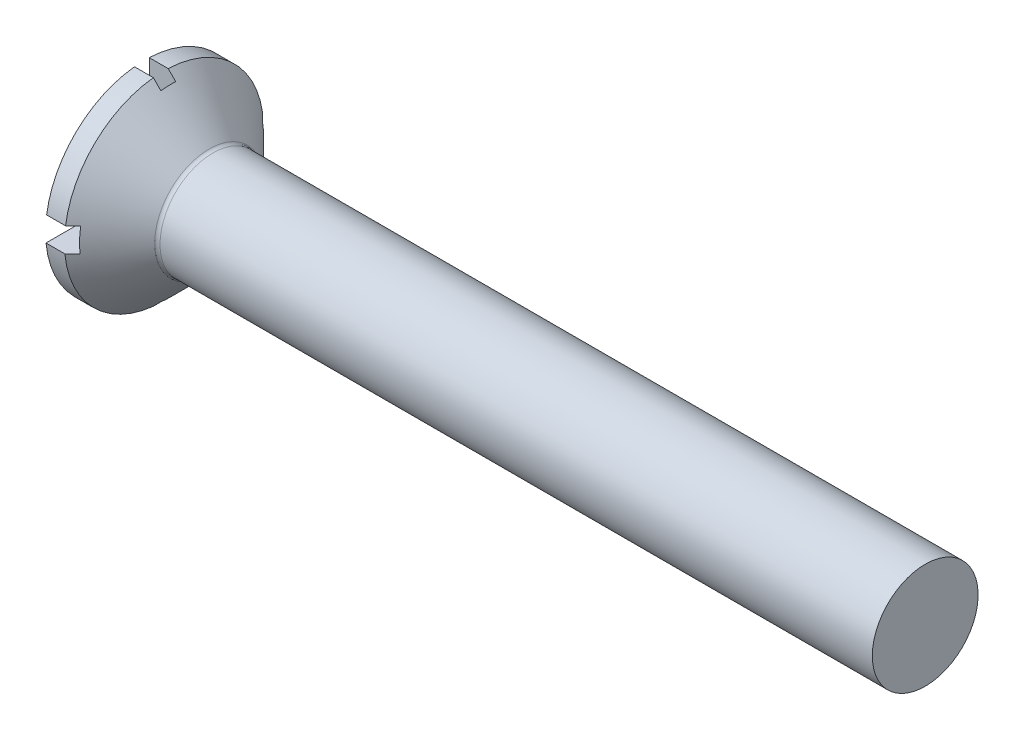
ISO-10303-21;
HEADER;
FILE_DESCRIPTION(('STEP AP214'),'2;1');
FILE_NAME('part.step','',(''),(''),'','','');
FILE_SCHEMA(('AUTOMOTIVE_DESIGN { 1 0 10303 214 1 1 1 1 }'));
ENDSEC;
DATA;
#1=APPLICATION_CONTEXT('core data for automotive mechanical design processes');
#2=APPLICATION_PROTOCOL_DEFINITION('international standard','automotive_design',2000,#1);
#3=PRODUCT_CONTEXT('',#1,'mechanical');
#4=PRODUCT('Part','Part','',(#3));
#5=PRODUCT_RELATED_PRODUCT_CATEGORY('part','',(#4));
#6=PRODUCT_DEFINITION_FORMATION('','',#4);
#7=PRODUCT_DEFINITION_CONTEXT('part definition',#1,'design');
#8=PRODUCT_DEFINITION('design','',#6,#7);
#9=PRODUCT_DEFINITION_SHAPE('','',#8);
#10=(LENGTH_UNIT() NAMED_UNIT(*) SI_UNIT(.MILLI.,.METRE.));
#11=(NAMED_UNIT(*) PLANE_ANGLE_UNIT() SI_UNIT($,.RADIAN.));
#12=(NAMED_UNIT(*) SI_UNIT($,.STERADIAN.) SOLID_ANGLE_UNIT());
#13=UNCERTAINTY_MEASURE_WITH_UNIT(LENGTH_MEASURE(1.E-05),#10,'distance_accuracy_value','');
#14=(GEOMETRIC_REPRESENTATION_CONTEXT(3) GLOBAL_UNCERTAINTY_ASSIGNED_CONTEXT((#13)) GLOBAL_UNIT_ASSIGNED_CONTEXT((#10,
#11,#12)) REPRESENTATION_CONTEXT('',''));
#15=CARTESIAN_POINT('',(0.,0.,0.));
#16=DIRECTION('',(0.,0.,1.));
#17=DIRECTION('',(1.,0.,0.));
#18=AXIS2_PLACEMENT_3D('',#15,#16,#17);
#19=CARTESIAN_POINT('',(1.,0.,0.));
#20=DIRECTION('',(-1.,0.,0.));
#21=DIRECTION('',(0.,0.,1.));
#22=AXIS2_PLACEMENT_3D('',#19,#20,#21);
#23=PLANE('',#22);
#24=DIRECTION('',(0.,1.,0.));
#25=VECTOR('',#24,1.);
#26=CARTESIAN_POINT('',(1.,-0.355709243839864,-0.156923110621762));
#27=LINE('',#26,#25);
#28=CARTESIAN_POINT('',(1.,-0.355709243839864,-0.156923110621762));
#29=VERTEX_POINT('',#28);
#30=CARTESIAN_POINT('',(1.0000000000166,-3.47646014463617,-0.156923110621762));
#31=VERTEX_POINT('',#30);
#32=EDGE_CURVE('E337',#29,#31,#27,.F.);
#33=ORIENTED_EDGE('',*,*,#32,.T.);
#34=CARTESIAN_POINT('',(1.0000000000332,0.,0.));
#35=DIRECTION('',(-1.,0.,0.));
#36=DIRECTION('',(0.,0.,1.));
#37=AXIS2_PLACEMENT_3D('',#34,#35,#36);
#38=CIRCLE('',#37,3.47999999996773);
#39=CARTESIAN_POINT('',(1.00000000002008,-3.456568160324,0.403158223159427));
#40=VERTEX_POINT('',#39);
#41=EDGE_CURVE('E237',#31,#40,#38,.T.);
#42=ORIENTED_EDGE('',*,*,#41,.T.);
#43=DIRECTION('',(0.,-1.,0.));
#44=VECTOR('',#43,1.);
#45=CARTESIAN_POINT('',(1.,-4.05674824255773,0.403158223159427));
#46=LINE('',#45,#44);
#47=CARTESIAN_POINT('',(1.,-0.355709243839864,0.403158223159425));
#48=VERTEX_POINT('',#47);
#49=EDGE_CURVE('E138',#40,#48,#46,.F.);
#50=ORIENTED_EDGE('',*,*,#49,.T.);
#51=DIRECTION('',(0.,0.,-1.));
#52=VECTOR('',#51,1.);
#53=CARTESIAN_POINT('',(1.,-0.355709243839864,0.403158223159425));
#54=LINE('',#53,#52);
#55=CARTESIAN_POINT('',(1.0000000000166,-0.355709243839867,3.46177280215467));
#56=VERTEX_POINT('',#55);
#57=EDGE_CURVE('E154',#48,#56,#54,.F.);
#58=ORIENTED_EDGE('',*,*,#57,.T.);
#59=CARTESIAN_POINT('',(1.0000000000332,0.,0.));
#60=DIRECTION('',(-1.,0.,0.));
#61=DIRECTION('',(0.,0.,1.));
#62=AXIS2_PLACEMENT_3D('',#59,#60,#61);
#63=CIRCLE('',#62,3.47999999996773);
#64=CARTESIAN_POINT('',(1.00000000002006,0.550618510763713,3.43616345005169));
#65=VERTEX_POINT('',#64);
#66=EDGE_CURVE('E19',#56,#65,#63,.T.);
#67=ORIENTED_EDGE('',*,*,#66,.T.);
#68=DIRECTION('',(0.,0.,1.));
#69=VECTOR('',#68,1.);
#70=CARTESIAN_POINT('',(1.,0.550618510763713,4.40763775047384));
#71=LINE('',#70,#69);
#72=CARTESIAN_POINT('',(1.,0.550618510763712,0.403158223159425));
#73=VERTEX_POINT('',#72);
#74=EDGE_CURVE('E118',#65,#73,#71,.F.);
#75=ORIENTED_EDGE('',*,*,#74,.T.);
#76=DIRECTION('',(0.,-1.,0.));
#77=VECTOR('',#76,1.);
#78=CARTESIAN_POINT('',(1.,0.550618510763713,0.403158223159425));
#79=LINE('',#78,#77);
#80=CARTESIAN_POINT('',(1.0000000000166,3.4565681603275,0.403158223159424));
#81=VERTEX_POINT('',#80);
#82=EDGE_CURVE('E346',#73,#81,#79,.F.);
#83=ORIENTED_EDGE('',*,*,#82,.T.);
#84=CARTESIAN_POINT('',(1.0000000000332,0.,0.));
#85=DIRECTION('',(-1.,0.,0.));
#86=DIRECTION('',(0.,0.,1.));
#87=AXIS2_PLACEMENT_3D('',#84,#85,#86);
#88=CIRCLE('',#87,3.47999999996773);
#89=CARTESIAN_POINT('',(1.0000000000201,3.47646014463266,-0.156923110621762));
#90=VERTEX_POINT('',#89);
#91=EDGE_CURVE('E153',#81,#90,#88,.T.);
#92=ORIENTED_EDGE('',*,*,#91,.T.);
#93=DIRECTION('',(0.,1.,0.));
#94=VECTOR('',#93,1.);
#95=CARTESIAN_POINT('',(1.,4.34325175744227,-0.156923110621762));
#96=LINE('',#95,#94);
#97=CARTESIAN_POINT('',(1.,0.550618510763712,-0.156923110621762));
#98=VERTEX_POINT('',#97);
#99=EDGE_CURVE('E348',#90,#98,#96,.F.);
#100=ORIENTED_EDGE('',*,*,#99,.T.);
#101=DIRECTION('',(0.,0.,1.));
#102=VECTOR('',#101,1.);
#103=CARTESIAN_POINT('',(1.,0.550618510763713,-0.156923110621761));
#104=LINE('',#103,#102);
#105=CARTESIAN_POINT('',(1.0000000000166,0.550618510763713,-3.4361634500552));
#106=VERTEX_POINT('',#105);
#107=EDGE_CURVE('E236',#98,#106,#104,.F.);
#108=ORIENTED_EDGE('',*,*,#107,.T.);
#109=CARTESIAN_POINT('',(1.0000000000332,0.,0.));
#110=DIRECTION('',(-1.,0.,0.));
#111=DIRECTION('',(0.,0.,1.));
#112=AXIS2_PLACEMENT_3D('',#109,#110,#111);
#113=CIRCLE('',#112,3.47999999996773);
#114=CARTESIAN_POINT('',(1.00000000002009,-0.355709243839861,-3.46177280215116));
#115=VERTEX_POINT('',#114);
#116=EDGE_CURVE('E409',#106,#115,#113,.T.);
#117=ORIENTED_EDGE('',*,*,#116,.T.);
#118=DIRECTION('',(0.,0.,-1.));
#119=VECTOR('',#118,1.);
#120=CARTESIAN_POINT('',(1.,-0.355709243839861,-4.09236224952616));
#121=LINE('',#120,#119);
#122=EDGE_CURVE('E147',#115,#29,#121,.F.);
#123=ORIENTED_EDGE('',*,*,#122,.T.);
#124=EDGE_LOOP('',(#33,#42,#50,#58,#67,#75,#83,#92,#100,#108,#117,#123));
#125=FACE_BOUND('',#124,.T.);
#126=ADVANCED_FACE('F16',(#125),#23,.T.);
#127=CARTESIAN_POINT('',(1.,0.550618510763713,-0.156923110621761));
#128=DIRECTION('',(0.,1.,0.));
#129=DIRECTION('',(0.,0.,1.));
#130=AXIS2_PLACEMENT_3D('',#127,#128,#129);
#131=PLANE('',#130);
#132=CARTESIAN_POINT('',(1.00000000000693,0.550618510763713,-3.43616345006499));
#133=CARTESIAN_POINT('',(0.952522390497496,0.550618510763713,-3.48424489385891));
#134=CARTESIAN_POINT('',(0.905033585692067,0.550618510763713,-3.53231527264755));
#135=CARTESIAN_POINT('',(0.810033585692013,0.550618510763713,-3.62843390000909));
#136=CARTESIAN_POINT('',(0.762522390497485,0.550618510763712,-3.67648214858208));
#137=CARTESIAN_POINT('',(0.715000000007059,0.550618510763712,-3.72451933214988));
#138=B_SPLINE_CURVE_WITH_KNOTS('',3,(#132,#133,#134,#135,#136,#137),.UNSPECIFIED.,.F.,.F.,(4,2,
4),(0.,0.202715394305867,0.405430787746274),.UNSPECIFIED.);
#139=CARTESIAN_POINT('',(0.715000000010424,0.550618510763712,-3.72451933215298));
#140=VERTEX_POINT('',#139);
#141=EDGE_CURVE('E229',#106,#140,#138,.T.);
#142=ORIENTED_EDGE('',*,*,#141,.F.);
#143=ORIENTED_EDGE('',*,*,#107,.F.);
#144=DIRECTION('',(-1.,0.,0.));
#145=VECTOR('',#144,1.);
#146=CARTESIAN_POINT('',(1.,0.550618510763712,-0.156923110621762));
#147=LINE('',#146,#145);
#148=CARTESIAN_POINT('',(0.,0.550618510763712,-0.156923110621762));
#149=VERTEX_POINT('',#148);
#150=EDGE_CURVE('E129',#98,#149,#147,.T.);
#151=ORIENTED_EDGE('',*,*,#150,.T.);
#152=DIRECTION('',(0.,0.,-1.));
#153=VECTOR('',#152,1.);
#154=CARTESIAN_POINT('',(0.,0.550618510763712,0.));
#155=LINE('',#154,#153);
#156=CARTESIAN_POINT('',(0.,0.550618510763712,-3.72451933215608));
#157=VERTEX_POINT('',#156);
#158=EDGE_CURVE('E316',#149,#157,#155,.T.);
#159=ORIENTED_EDGE('',*,*,#158,.T.);
#160=DIRECTION('',(1.,0.,0.));
#161=VECTOR('',#160,1.);
#162=CARTESIAN_POINT('',(1.,0.550618510763712,-3.72451933215607));
#163=LINE('',#162,#161);
#164=EDGE_CURVE('E235',#140,#157,#163,.F.);
#165=ORIENTED_EDGE('',*,*,#164,.F.);
#166=EDGE_LOOP('',(#142,#143,#151,#159,#165));
#167=FACE_BOUND('',#166,.T.);
#168=ADVANCED_FACE('F239',(#167),#131,.F.);
#169=CARTESIAN_POINT('',(1.,4.34325175744227,-0.156923110621762));
#170=DIRECTION('',(0.,0.,-1.));
#171=DIRECTION('',(-1.,0.,0.));
#172=AXIS2_PLACEMENT_3D('',#169,#170,#171);
#173=PLANE('',#172);
#174=DIRECTION('',(0.,1.,0.));
#175=VECTOR('',#174,1.);
#176=CARTESIAN_POINT('',(0.,0.,-0.156923110621762));
#177=LINE('',#176,#175);
#178=CARTESIAN_POINT('',(0.,3.7617283444386,-0.156923110621762));
#179=VERTEX_POINT('',#178);
#180=EDGE_CURVE('E312',#179,#149,#177,.F.);
#181=ORIENTED_EDGE('',*,*,#180,.T.);
#182=ORIENTED_EDGE('',*,*,#150,.F.);
#183=ORIENTED_EDGE('',*,*,#99,.F.);
#184=CARTESIAN_POINT('',(0.715000000003793,3.76172834443573,-0.156923110621762));
#185=CARTESIAN_POINT('',(0.762501760869479,3.71418540368166,-0.156923110621762));
#186=CARTESIAN_POINT('',(0.81000264130227,3.66664158332245,-0.156923110621762));
#187=CARTESIAN_POINT('',(0.905002641303341,3.57155218339247,-0.156923110621762));
#188=CARTESIAN_POINT('',(0.952501760871621,3.52400660382169,-0.156923110621762));
#189=CARTESIAN_POINT('',(1.00000000000701,3.47646014464577,-0.156923110621762));
#190=B_SPLINE_CURVE_WITH_KNOTS('',3,(#184,#185,#186,#187,#188,#189),.UNSPECIFIED.,.F.,.F.,(4,2,
4),(0.,0.201620277914085,0.403240555833609),.UNSPECIFIED.);
#191=CARTESIAN_POINT('',(0.715000000007359,3.76172834443217,-0.156923110621762));
#192=VERTEX_POINT('',#191);
#193=EDGE_CURVE('E221',#192,#90,#190,.T.);
#194=ORIENTED_EDGE('',*,*,#193,.F.);
#195=DIRECTION('',(-1.,0.,0.));
#196=VECTOR('',#195,1.);
#197=CARTESIAN_POINT('',(1.,3.7617283444386,-0.156923110621762));
#198=LINE('',#197,#196);
#199=EDGE_CURVE('E344',#179,#192,#198,.F.);
#200=ORIENTED_EDGE('',*,*,#199,.F.);
#201=EDGE_LOOP('',(#181,#182,#183,#194,#200));
#202=FACE_BOUND('',#201,.T.);
#203=ADVANCED_FACE('F242',(#202),#173,.F.);
#204=CARTESIAN_POINT('',(1.,0.550618510763713,0.403158223159425));
#205=DIRECTION('',(0.,0.,1.));
#206=DIRECTION('',(0.,-1.,0.));
#207=AXIS2_PLACEMENT_3D('',#204,#205,#206);
#208=PLANE('',#207);
#209=CARTESIAN_POINT('',(1.00000000000697,3.4565681603372,0.403158223159424));
#210=CARTESIAN_POINT('',(0.952511808864706,3.50437729702399,0.403158223159424));
#211=CARTESIAN_POINT('',(0.905017713279324,3.55218056600584,0.403158223159424));
#212=CARTESIAN_POINT('',(0.810017713279351,3.64777536850222,0.403158223159424));
#213=CARTESIAN_POINT('',(0.762511808864773,3.69556690201678,0.403158223159424));
#214=CARTESIAN_POINT('',(0.715000000007091,3.7433525678264,0.403158223159424));
#215=B_SPLINE_CURVE_WITH_KNOTS('',3,(#209,#210,#211,#212,#213,#214),.UNSPECIFIED.,.F.,.F.,(4,2,
4),(0.,0.202157302038321,0.404314603833935),.UNSPECIFIED.);
#216=CARTESIAN_POINT('',(0.715000000010439,3.7433525678295,0.403158223159424));
#217=VERTEX_POINT('',#216);
#218=EDGE_CURVE('E213',#81,#217,#215,.T.);
#219=ORIENTED_EDGE('',*,*,#218,.F.);
#220=ORIENTED_EDGE('',*,*,#82,.F.);
#221=DIRECTION('',(1.,0.,0.));
#222=VECTOR('',#221,1.);
#223=CARTESIAN_POINT('',(1.,0.550618510763712,0.403158223159425));
#224=LINE('',#223,#222);
#225=CARTESIAN_POINT('',(0.,0.550618510763713,0.403158223159425));
#226=VERTEX_POINT('',#225);
#227=EDGE_CURVE('E338',#73,#226,#224,.F.);
#228=ORIENTED_EDGE('',*,*,#227,.T.);
#229=DIRECTION('',(0.,1.,0.));
#230=VECTOR('',#229,1.);
#231=CARTESIAN_POINT('',(0.,0.,0.403158223159425));
#232=LINE('',#231,#230);
#233=CARTESIAN_POINT('',(0.,3.7433525678326,0.403158223159424));
#234=VERTEX_POINT('',#233);
#235=EDGE_CURVE('E307',#226,#234,#232,.T.);
#236=ORIENTED_EDGE('',*,*,#235,.T.);
#237=DIRECTION('',(1.,0.,0.));
#238=VECTOR('',#237,1.);
#239=CARTESIAN_POINT('',(1.,3.7433525678326,0.403158223159424));
#240=LINE('',#239,#238);
#241=EDGE_CURVE('E342',#217,#234,#240,.F.);
#242=ORIENTED_EDGE('',*,*,#241,.F.);
#243=EDGE_LOOP('',(#219,#220,#228,#236,#242));
#244=FACE_BOUND('',#243,.T.);
#245=ADVANCED_FACE('F245',(#244),#208,.F.);
#246=CARTESIAN_POINT('',(1.,0.550618510763713,4.40763775047384));
#247=DIRECTION('',(0.,1.,0.));
#248=DIRECTION('',(0.,0.,1.));
#249=AXIS2_PLACEMENT_3D('',#246,#247,#248);
#250=PLANE('',#249);
#251=DIRECTION('',(0.,0.,-1.));
#252=VECTOR('',#251,1.);
#253=CARTESIAN_POINT('',(0.,0.550618510763713,0.));
#254=LINE('',#253,#252);
#255=CARTESIAN_POINT('',(0.,0.550618510763713,3.72451933215608));
#256=VERTEX_POINT('',#255);
#257=EDGE_CURVE('E302',#256,#226,#254,.T.);
#258=ORIENTED_EDGE('',*,*,#257,.T.);
#259=ORIENTED_EDGE('',*,*,#227,.F.);
#260=ORIENTED_EDGE('',*,*,#74,.F.);
#261=CARTESIAN_POINT('',(0.715000000003765,0.550618510763713,3.72451933215321));
#262=CARTESIAN_POINT('',(0.76252239049474,0.550618510763713,3.67648214858485));
#263=CARTESIAN_POINT('',(0.810033585689818,0.550618510763713,3.62843390001131));
#264=CARTESIAN_POINT('',(0.90503358569097,0.550618510763713,3.53231527264866));
#265=CARTESIAN_POINT('',(0.952522390496948,0.550618510763713,3.48424489385947));
#266=CARTESIAN_POINT('',(1.00000000000693,0.550618510763713,3.43616345006499));
#267=B_SPLINE_CURVE_WITH_KNOTS('',3,(#261,#262,#263,#264,#265,#266),.UNSPECIFIED.,.F.,.F.,(4,2,
4),(0.,0.202715393442749,0.405430787750959),.UNSPECIFIED.);
#268=CARTESIAN_POINT('',(0.715000000007359,0.550618510763713,3.72451933214958));
#269=VERTEX_POINT('',#268);
#270=EDGE_CURVE('E111',#269,#65,#267,.T.);
#271=ORIENTED_EDGE('',*,*,#270,.F.);
#272=DIRECTION('',(1.,0.,0.));
#273=VECTOR('',#272,1.);
#274=CARTESIAN_POINT('',(1.,0.550618510763713,3.72451933215607));
#275=LINE('',#274,#273);
#276=EDGE_CURVE('E335',#256,#269,#275,.T.);
#277=ORIENTED_EDGE('',*,*,#276,.F.);
#278=EDGE_LOOP('',(#258,#259,#260,#271,#277));
#279=FACE_BOUND('',#278,.T.);
#280=ADVANCED_FACE('F249',(#279),#250,.F.);
#281=CARTESIAN_POINT('',(1.,-0.355709243839864,-0.156923110621762));
#282=DIRECTION('',(0.,0.,-1.));
#283=DIRECTION('',(-1.,0.,0.));
#284=AXIS2_PLACEMENT_3D('',#281,#282,#283);
#285=PLANE('',#284);
#286=CARTESIAN_POINT('',(1.00000000000701,-3.47646014464577,-0.156923110621762));
#287=CARTESIAN_POINT('',(0.952501760872176,-3.52400660382113,-0.156923110621762));
#288=CARTESIAN_POINT('',(0.90500264130445,-3.57155218339136,-0.156923110621762));
#289=CARTESIAN_POINT('',(0.810002641304488,-3.66664158332023,-0.156923110621762));
#290=CARTESIAN_POINT('',(0.762501760872253,-3.71418540367889,-0.156923110621762));
#291=CARTESIAN_POINT('',(0.715000000007121,-3.7617283444324,-0.156923110621762));
#292=B_SPLINE_CURVE_WITH_KNOTS('',3,(#286,#287,#288,#289,#290,#291),.UNSPECIFIED.,.F.,.F.,(4,2,
4),(0.,0.20162027791717,0.4032405558289),.UNSPECIFIED.);
#293=CARTESIAN_POINT('',(0.715000000010455,-3.7617283444355,-0.156923110621762));
#294=VERTEX_POINT('',#293);
#295=EDGE_CURVE('E197',#31,#294,#292,.T.);
#296=ORIENTED_EDGE('',*,*,#295,.F.);
#297=ORIENTED_EDGE('',*,*,#32,.F.);
#298=DIRECTION('',(1.,0.,0.));
#299=VECTOR('',#298,1.);
#300=CARTESIAN_POINT('',(1.,-0.355709243839864,-0.156923110621762));
#301=LINE('',#300,#299);
#302=CARTESIAN_POINT('',(0.,-0.355709243839862,-0.156923110621762));
#303=VERTEX_POINT('',#302);
#304=EDGE_CURVE('E329',#29,#303,#301,.F.);
#305=ORIENTED_EDGE('',*,*,#304,.T.);
#306=DIRECTION('',(0.,1.,0.));
#307=VECTOR('',#306,1.);
#308=CARTESIAN_POINT('',(0.,0.,-0.156923110621762));
#309=LINE('',#308,#307);
#310=CARTESIAN_POINT('',(0.,-3.7617283444386,-0.156923110621762));
#311=VERTEX_POINT('',#310);
#312=EDGE_CURVE('E297',#303,#311,#309,.F.);
#313=ORIENTED_EDGE('',*,*,#312,.T.);
#314=DIRECTION('',(-1.,0.,0.));
#315=VECTOR('',#314,1.);
#316=CARTESIAN_POINT('',(1.,-3.7617283444386,-0.156923110621762));
#317=LINE('',#316,#315);
#318=EDGE_CURVE('E333',#294,#311,#317,.T.);
#319=ORIENTED_EDGE('',*,*,#318,.F.);
#320=EDGE_LOOP('',(#296,#297,#305,#313,#319));
#321=FACE_BOUND('',#320,.T.);
#322=ADVANCED_FACE('F253',(#321),#285,.F.);
#323=CARTESIAN_POINT('',(1.,-0.355709243839861,-4.09236224952616));
#324=DIRECTION('',(0.,-1.,0.));
#325=DIRECTION('',(0.,0.,-1.));
#326=AXIS2_PLACEMENT_3D('',#323,#324,#325);
#327=PLANE('',#326);
#328=DIRECTION('',(0.,0.,-1.));
#329=VECTOR('',#328,1.);
#330=CARTESIAN_POINT('',(0.,-0.355709243839861,0.));
#331=LINE('',#330,#329);
#332=CARTESIAN_POINT('',(0.,-0.355709243839861,-3.74815900594504));
#333=VERTEX_POINT('',#332);
#334=EDGE_CURVE('E293',#333,#303,#331,.F.);
#335=ORIENTED_EDGE('',*,*,#334,.T.);
#336=ORIENTED_EDGE('',*,*,#304,.F.);
#337=ORIENTED_EDGE('',*,*,#122,.F.);
#338=CARTESIAN_POINT('',(0.715000000003782,-0.355709243839861,-3.74815900594217));
#339=CARTESIAN_POINT('',(0.762509154586003,-0.355709243839861,-3.70043708228406));
#340=CARTESIAN_POINT('',(0.810013731868789,-0.355709243839861,-3.65271060348215));
#341=CARTESIAN_POINT('',(0.905013731869861,-0.355709243839861,-3.55724853555621));
#342=CARTESIAN_POINT('',(0.95250915458814,-0.355709243839861,-3.50951294643218));
#343=CARTESIAN_POINT('',(1.00000000000698,-0.355709243839861,-3.46177280216434));
#344=B_SPLINE_CURVE_WITH_KNOTS('',3,(#338,#339,#340,#341,#342,#343),.UNSPECIFIED.,.F.,.F.,(4,2,
4),(0.,0.202016125036606,0.404032250219377),.UNSPECIFIED.);
#345=CARTESIAN_POINT('',(0.715000000007358,-0.355709243839861,-3.74815900593858));
#346=VERTEX_POINT('',#345);
#347=EDGE_CURVE('E178',#346,#115,#344,.T.);
#348=ORIENTED_EDGE('',*,*,#347,.F.);
#349=DIRECTION('',(1.,0.,0.));
#350=VECTOR('',#349,1.);
#351=CARTESIAN_POINT('',(1.,-0.355709243839861,-3.74815900594503));
#352=LINE('',#351,#350);
#353=EDGE_CURVE('E158',#333,#346,#352,.T.);
#354=ORIENTED_EDGE('',*,*,#353,.F.);
#355=EDGE_LOOP('',(#335,#336,#337,#348,#354));
#356=FACE_BOUND('',#355,.T.);
#357=ADVANCED_FACE('F257',(#356),#327,.F.);
#358=CARTESIAN_POINT('',(1.,-0.355709243839864,0.403158223159425));
#359=DIRECTION('',(0.,-1.,0.));
#360=DIRECTION('',(0.,0.,-1.));
#361=AXIS2_PLACEMENT_3D('',#358,#359,#360);
#362=PLANE('',#361);
#363=CARTESIAN_POINT('',(1.00000000000698,-0.355709243839867,3.46177280216434));
#364=CARTESIAN_POINT('',(0.952509154588694,-0.355709243839867,3.50951294643162));
#365=CARTESIAN_POINT('',(0.905013731870968,-0.355709243839867,3.5572485355551));
#366=CARTESIAN_POINT('',(0.810013731871,-0.355709243839867,3.65271060347993));
#367=CARTESIAN_POINT('',(0.762509154588766,-0.355709243839867,3.70043708228128));
#368=CARTESIAN_POINT('',(0.715000000007098,-0.355709243839868,3.74815900593884));
#369=B_SPLINE_CURVE_WITH_KNOTS('',3,(#363,#364,#365,#366,#367,#368),.UNSPECIFIED.,.F.,.F.,(4,2,
4),(0.,0.202016125180422,0.404032250214679),.UNSPECIFIED.);
#370=CARTESIAN_POINT('',(0.715000000010443,-0.355709243839868,3.74815900594194));
#371=VERTEX_POINT('',#370);
#372=EDGE_CURVE('E152',#56,#371,#369,.T.);
#373=ORIENTED_EDGE('',*,*,#372,.F.);
#374=ORIENTED_EDGE('',*,*,#57,.F.);
#375=DIRECTION('',(1.,0.,0.));
#376=VECTOR('',#375,1.);
#377=CARTESIAN_POINT('',(1.,-0.355709243839864,0.403158223159425));
#378=LINE('',#377,#376);
#379=CARTESIAN_POINT('',(0.,-0.355709243839864,0.403158223159426));
#380=VERTEX_POINT('',#379);
#381=EDGE_CURVE('E324',#48,#380,#378,.F.);
#382=ORIENTED_EDGE('',*,*,#381,.T.);
#383=DIRECTION('',(0.,0.,-1.));
#384=VECTOR('',#383,1.);
#385=CARTESIAN_POINT('',(0.,-0.355709243839864,0.));
#386=LINE('',#385,#384);
#387=CARTESIAN_POINT('',(0.,-0.355709243839866,3.74815900594503));
#388=VERTEX_POINT('',#387);
#389=EDGE_CURVE('E289',#380,#388,#386,.F.);
#390=ORIENTED_EDGE('',*,*,#389,.T.);
#391=DIRECTION('',(1.,0.,0.));
#392=VECTOR('',#391,1.);
#393=CARTESIAN_POINT('',(1.,-0.355709243839868,3.74815900594503));
#394=LINE('',#393,#392);
#395=EDGE_CURVE('E34',#371,#388,#394,.F.);
#396=ORIENTED_EDGE('',*,*,#395,.F.);
#397=EDGE_LOOP('',(#373,#374,#382,#390,#396));
#398=FACE_BOUND('',#397,.T.);
#399=ADVANCED_FACE('F160',(#398),#362,.F.);
#400=CARTESIAN_POINT('',(1.,-4.05674824255773,0.403158223159427));
#401=DIRECTION('',(0.,0.,1.));
#402=DIRECTION('',(0.,-1.,0.));
#403=AXIS2_PLACEMENT_3D('',#400,#401,#402);
#404=PLANE('',#403);
#405=DIRECTION('',(0.,1.,0.));
#406=VECTOR('',#405,1.);
#407=CARTESIAN_POINT('',(0.,0.,0.403158223159427));
#408=LINE('',#407,#406);
#409=CARTESIAN_POINT('',(0.,-3.7433525678326,0.403158223159427));
#410=VERTEX_POINT('',#409);
#411=EDGE_CURVE('E285',#410,#380,#408,.T.);
#412=ORIENTED_EDGE('',*,*,#411,.T.);
#413=ORIENTED_EDGE('',*,*,#381,.F.);
#414=ORIENTED_EDGE('',*,*,#49,.F.);
#415=CARTESIAN_POINT('',(0.715000000003779,-3.74335256782973,0.403158223159427));
#416=CARTESIAN_POINT('',(0.762511808862014,-3.69556690201956,0.403158223159427));
#417=CARTESIAN_POINT('',(0.810017713277144,-3.64777536850444,0.403158223159427));
#418=CARTESIAN_POINT('',(0.905017713278221,-3.55218056600695,0.403158223159427));
#419=CARTESIAN_POINT('',(0.952511808864155,-3.50437729702455,0.403158223159427));
#420=CARTESIAN_POINT('',(1.00000000000697,-3.4565681603372,0.403158223159427));
#421=B_SPLINE_CURVE_WITH_KNOTS('',3,(#415,#416,#417,#418,#419,#420),.UNSPECIFIED.,.F.,.F.,(4,2,
4),(0.,0.202157301797964,0.404314603838633),.UNSPECIFIED.);
#422=CARTESIAN_POINT('',(0.715000000007358,-3.74335256782613,0.403158223159427));
#423=VERTEX_POINT('',#422);
#424=EDGE_CURVE('E162',#423,#40,#421,.T.);
#425=ORIENTED_EDGE('',*,*,#424,.F.);
#426=DIRECTION('',(1.,0.,0.));
#427=VECTOR('',#426,1.);
#428=CARTESIAN_POINT('',(1.,-3.7433525678326,0.403158223159427));
#429=LINE('',#428,#427);
#430=EDGE_CURVE('E320',#410,#423,#429,.T.);
#431=ORIENTED_EDGE('',*,*,#430,.F.);
#432=EDGE_LOOP('',(#412,#413,#414,#425,#431));
#433=FACE_BOUND('',#432,.T.);
#434=ADVANCED_FACE('F266',(#433),#404,.F.);
#435=CARTESIAN_POINT('',(0.,0.,0.));
#436=DIRECTION('',(1.,0.,0.));
#437=DIRECTION('',(0.,0.,-1.));
#438=AXIS2_PLACEMENT_3D('',#435,#436,#437);
#439=PLANE('',#438);
#440=CARTESIAN_POINT('',(0.,0.,0.));
#441=DIRECTION('',(1.,0.,0.));
#442=DIRECTION('',(0.,0.,-1.));
#443=AXIS2_PLACEMENT_3D('',#440,#441,#442);
#444=CIRCLE('',#443,3.765);
#445=EDGE_CURVE('E288',#157,#179,#444,.T.);
#446=ORIENTED_EDGE('',*,*,#445,.F.);
#447=ORIENTED_EDGE('',*,*,#158,.F.);
#448=ORIENTED_EDGE('',*,*,#180,.F.);
#449=EDGE_LOOP('',(#446,#447,#448));
#450=FACE_BOUND('',#449,.T.);
#451=ADVANCED_FACE('F404',(#450),#439,.F.);
#452=CARTESIAN_POINT('',(0.,0.,0.));
#453=DIRECTION('',(1.,0.,0.));
#454=DIRECTION('',(0.,0.,-1.));
#455=AXIS2_PLACEMENT_3D('',#452,#453,#454);
#456=PLANE('',#455);
#457=CARTESIAN_POINT('',(0.,0.,0.));
#458=DIRECTION('',(1.,0.,0.));
#459=DIRECTION('',(0.,0.,-1.));
#460=AXIS2_PLACEMENT_3D('',#457,#458,#459);
#461=CIRCLE('',#460,3.765);
#462=EDGE_CURVE('E393',#234,#256,#461,.T.);
#463=ORIENTED_EDGE('',*,*,#462,.F.);
#464=ORIENTED_EDGE('',*,*,#235,.F.);
#465=ORIENTED_EDGE('',*,*,#257,.F.);
#466=EDGE_LOOP('',(#463,#464,#465));
#467=FACE_BOUND('',#466,.T.);
#468=ADVANCED_FACE('F438',(#467),#456,.F.);
#469=CARTESIAN_POINT('',(0.,0.,0.));
#470=DIRECTION('',(1.,0.,0.));
#471=DIRECTION('',(0.,0.,-1.));
#472=AXIS2_PLACEMENT_3D('',#469,#470,#471);
#473=PLANE('',#472);
#474=CARTESIAN_POINT('',(0.,0.,0.));
#475=DIRECTION('',(1.,0.,0.));
#476=DIRECTION('',(0.,0.,-1.));
#477=AXIS2_PLACEMENT_3D('',#474,#475,#476);
#478=CIRCLE('',#477,3.765);
#479=EDGE_CURVE('E390',#311,#333,#478,.T.);
#480=ORIENTED_EDGE('',*,*,#479,.F.);
#481=ORIENTED_EDGE('',*,*,#312,.F.);
#482=ORIENTED_EDGE('',*,*,#334,.F.);
#483=EDGE_LOOP('',(#480,#481,#482));
#484=FACE_BOUND('',#483,.T.);
#485=ADVANCED_FACE('F435',(#484),#473,.F.);
#486=CARTESIAN_POINT('',(0.,0.,0.));
#487=DIRECTION('',(1.,0.,0.));
#488=DIRECTION('',(0.,0.,-1.));
#489=AXIS2_PLACEMENT_3D('',#486,#487,#488);
#490=PLANE('',#489);
#491=CARTESIAN_POINT('',(0.,0.,0.));
#492=DIRECTION('',(1.,0.,0.));
#493=DIRECTION('',(0.,0.,-1.));
#494=AXIS2_PLACEMENT_3D('',#491,#492,#493);
#495=CIRCLE('',#494,3.765);
#496=EDGE_CURVE('E378',#388,#410,#495,.T.);
#497=ORIENTED_EDGE('',*,*,#496,.F.);
#498=ORIENTED_EDGE('',*,*,#389,.F.);
#499=ORIENTED_EDGE('',*,*,#411,.F.);
#500=EDGE_LOOP('',(#497,#498,#499));
#501=FACE_BOUND('',#500,.T.);
#502=ADVANCED_FACE('F417',(#501),#490,.F.);
#503=CARTESIAN_POINT('',(11.8531386861314,0.,0.));
#504=DIRECTION('',(1.,0.,0.));
#505=DIRECTION('',(0.,0.,-1.));
#506=AXIS2_PLACEMENT_3D('',#503,#504,#505);
#507=CYLINDRICAL_SURFACE('',#506,3.765);
#508=ORIENTED_EDGE('',*,*,#164,.T.);
#509=ORIENTED_EDGE('',*,*,#445,.T.);
#510=ORIENTED_EDGE('',*,*,#199,.T.);
#511=CARTESIAN_POINT('',(0.715000000013788,0.,0.));
#512=DIRECTION('',(-1.,0.,0.));
#513=DIRECTION('',(0.,0.,-1.));
#514=AXIS2_PLACEMENT_3D('',#511,#512,#513);
#515=CIRCLE('',#514,3.76499999998714);
#516=EDGE_CURVE('E369',#140,#192,#515,.F.);
#517=ORIENTED_EDGE('',*,*,#516,.F.);
#518=EDGE_LOOP('',(#508,#509,#510,#517));
#519=FACE_BOUND('',#518,.T.);
#520=ADVANCED_FACE('F398',(#519),#507,.T.);
#521=CARTESIAN_POINT('',(11.8531386861314,0.,0.));
#522=DIRECTION('',(1.,0.,0.));
#523=DIRECTION('',(0.,0.,-1.));
#524=AXIS2_PLACEMENT_3D('',#521,#522,#523);
#525=CYLINDRICAL_SURFACE('',#524,3.765);
#526=ORIENTED_EDGE('',*,*,#241,.T.);
#527=ORIENTED_EDGE('',*,*,#462,.T.);
#528=ORIENTED_EDGE('',*,*,#276,.T.);
#529=CARTESIAN_POINT('',(0.715000000013788,0.,0.));
#530=DIRECTION('',(-1.,0.,0.));
#531=DIRECTION('',(0.,0.,-1.));
#532=AXIS2_PLACEMENT_3D('',#529,#530,#531);
#533=CIRCLE('',#532,3.76499999998714);
#534=EDGE_CURVE('E361',#217,#269,#533,.F.);
#535=ORIENTED_EDGE('',*,*,#534,.F.);
#536=EDGE_LOOP('',(#526,#527,#528,#535));
#537=FACE_BOUND('',#536,.T.);
#538=ADVANCED_FACE('F423',(#537),#525,.T.);
#539=CARTESIAN_POINT('',(11.8531386861314,0.,0.));
#540=DIRECTION('',(1.,0.,0.));
#541=DIRECTION('',(0.,0.,-1.));
#542=AXIS2_PLACEMENT_3D('',#539,#540,#541);
#543=CYLINDRICAL_SURFACE('',#542,3.765);
#544=ORIENTED_EDGE('',*,*,#318,.T.);
#545=ORIENTED_EDGE('',*,*,#479,.T.);
#546=ORIENTED_EDGE('',*,*,#353,.T.);
#547=CARTESIAN_POINT('',(0.715000000013788,0.,0.));
#548=DIRECTION('',(-1.,0.,0.));
#549=DIRECTION('',(0.,0.,-1.));
#550=AXIS2_PLACEMENT_3D('',#547,#548,#549);
#551=CIRCLE('',#550,3.76499999998714);
#552=EDGE_CURVE('E352',#294,#346,#551,.F.);
#553=ORIENTED_EDGE('',*,*,#552,.F.);
#554=EDGE_LOOP('',(#544,#545,#546,#553));
#555=FACE_BOUND('',#554,.T.);
#556=ADVANCED_FACE('F419',(#555),#543,.T.);
#557=CARTESIAN_POINT('',(11.8531386861314,0.,0.));
#558=DIRECTION('',(1.,0.,0.));
#559=DIRECTION('',(0.,0.,-1.));
#560=AXIS2_PLACEMENT_3D('',#557,#558,#559);
#561=CYLINDRICAL_SURFACE('',#560,3.765);
#562=ORIENTED_EDGE('',*,*,#395,.T.);
#563=ORIENTED_EDGE('',*,*,#496,.T.);
#564=ORIENTED_EDGE('',*,*,#430,.T.);
#565=CARTESIAN_POINT('',(0.715000000013788,0.,0.));
#566=DIRECTION('',(-1.,0.,0.));
#567=DIRECTION('',(0.,0.,-1.));
#568=AXIS2_PLACEMENT_3D('',#565,#566,#567);
#569=CIRCLE('',#568,3.76499999998714);
#570=EDGE_CURVE('E284',#371,#423,#569,.F.);
#571=ORIENTED_EDGE('',*,*,#570,.F.);
#572=EDGE_LOOP('',(#562,#563,#564,#571));
#573=FACE_BOUND('',#572,.T.);
#574=ADVANCED_FACE('F191',(#573),#561,.T.);
#575=CARTESIAN_POINT('',(0.715000000070631,0.,0.));
#576=DIRECTION('',(-1.,0.,0.));
#577=DIRECTION('',(0.,0.,1.));
#578=AXIS2_PLACEMENT_3D('',#575,#576,#577);
#579=CONICAL_SURFACE('',#578,3.7649999999303,0.785398163397448);
#580=CARTESIAN_POINT('',(2.42142135623731,0.,0.));
#581=DIRECTION('',(-1.,0.,0.));
#582=DIRECTION('',(0.,0.,-1.));
#583=AXIS2_PLACEMENT_3D('',#580,#581,#582);
#584=CIRCLE('',#583,2.05857864376269);
#585=CARTESIAN_POINT('',(2.42142135623731,0.,-2.05857864376269));
#586=VERTEX_POINT('',#585);
#587=EDGE_CURVE('E281',#586,#586,#584,.T.);
#588=ORIENTED_EDGE('',*,*,#587,.T.);
#589=EDGE_LOOP('',(#588));
#590=FACE_BOUND('',#589,.T.);
#591=ORIENTED_EDGE('',*,*,#372,.T.);
#592=ORIENTED_EDGE('',*,*,#570,.T.);
#593=ORIENTED_EDGE('',*,*,#424,.T.);
#594=ORIENTED_EDGE('',*,*,#41,.F.);
#595=ORIENTED_EDGE('',*,*,#295,.T.);
#596=ORIENTED_EDGE('',*,*,#552,.T.);
#597=ORIENTED_EDGE('',*,*,#347,.T.);
#598=ORIENTED_EDGE('',*,*,#116,.F.);
#599=ORIENTED_EDGE('',*,*,#141,.T.);
#600=ORIENTED_EDGE('',*,*,#516,.T.);
#601=ORIENTED_EDGE('',*,*,#193,.T.);
#602=ORIENTED_EDGE('',*,*,#91,.F.);
#603=ORIENTED_EDGE('',*,*,#218,.T.);
#604=ORIENTED_EDGE('',*,*,#534,.T.);
#605=ORIENTED_EDGE('',*,*,#270,.T.);
#606=ORIENTED_EDGE('',*,*,#66,.F.);
#607=EDGE_LOOP('',(#591,#592,#593,#594,#595,#596,#597,#598,#599,#600,#601,#602,#603,#604,#605,#606));
#608=FACE_BOUND('',#607,.T.);
#609=ADVANCED_FACE('F149',(#590,#608),#579,.T.);
#610=CARTESIAN_POINT('',(29.5,0.,0.));
#611=DIRECTION('',(-1.,0.,0.));
#612=DIRECTION('',(0.,0.,1.));
#613=AXIS2_PLACEMENT_3D('',#610,#611,#612);
#614=PLANE('',#613);
#615=CARTESIAN_POINT('',(29.5,0.,0.));
#616=DIRECTION('',(-1.,0.,0.));
#617=DIRECTION('',(0.,0.,1.));
#618=AXIS2_PLACEMENT_3D('',#615,#616,#617);
#619=CIRCLE('',#618,2.);
#620=CARTESIAN_POINT('',(29.5,0.,2.));
#621=VERTEX_POINT('',#620);
#622=EDGE_CURVE('E25',#621,#621,#619,.T.);
#623=ORIENTED_EDGE('',*,*,#622,.F.);
#624=EDGE_LOOP('',(#623));
#625=FACE_BOUND('',#624,.T.);
#626=ADVANCED_FACE('F190',(#625),#614,.F.);
#627=CARTESIAN_POINT('',(2.56284271247462,0.,0.));
#628=DIRECTION('',(-1.,0.,0.));
#629=DIRECTION('',(0.,0.,-1.));
#630=AXIS2_PLACEMENT_3D('',#627,#628,#629);
#631=TOROIDAL_SURFACE('',#630,2.2,0.2);
#632=CARTESIAN_POINT('',(2.56284271247462,0.,0.));
#633=DIRECTION('',(-1.,0.,0.));
#634=DIRECTION('',(0.,0.,1.));
#635=AXIS2_PLACEMENT_3D('',#632,#633,#634);
#636=CIRCLE('',#635,2.);
#637=CARTESIAN_POINT('',(2.56284271247462,0.,2.));
#638=VERTEX_POINT('',#637);
#639=EDGE_CURVE('E11',#638,#638,#636,.F.);
#640=ORIENTED_EDGE('',*,*,#639,.F.);
#641=EDGE_LOOP('',(#640));
#642=FACE_BOUND('',#641,.T.);
#643=ORIENTED_EDGE('',*,*,#587,.F.);
#644=EDGE_LOOP('',(#643));
#645=FACE_BOUND('',#644,.T.);
#646=ADVANCED_FACE('F270',(#642,#645),#631,.F.);
#647=CARTESIAN_POINT('',(-0.587069180985524,0.,0.));
#648=DIRECTION('',(-1.,0.,0.));
#649=DIRECTION('',(0.,0.,1.));
#650=AXIS2_PLACEMENT_3D('',#647,#648,#649);
#651=CYLINDRICAL_SURFACE('',#650,2.);
#652=ORIENTED_EDGE('',*,*,#639,.T.);
#653=EDGE_LOOP('',(#652));
#654=FACE_BOUND('',#653,.T.);
#655=ORIENTED_EDGE('',*,*,#622,.T.);
#656=EDGE_LOOP('',(#655));
#657=FACE_BOUND('',#656,.T.);
#658=ADVANCED_FACE('F268',(#654,#657),#651,.T.);
#659=CLOSED_SHELL('',(#126,#168,#203,#245,#280,#322,#357,#399,#434,#451,#468,#485,#502,#520,
#538,#556,#574,#609,#626,#646,#658));
#660=MANIFOLD_SOLID_BREP('B1',#659);
#661=ADVANCED_BREP_SHAPE_REPRESENTATION('',(#18,#660),#14);
#662=SHAPE_DEFINITION_REPRESENTATION(#9,#661);
ENDSEC;
END-ISO-10303-21;
